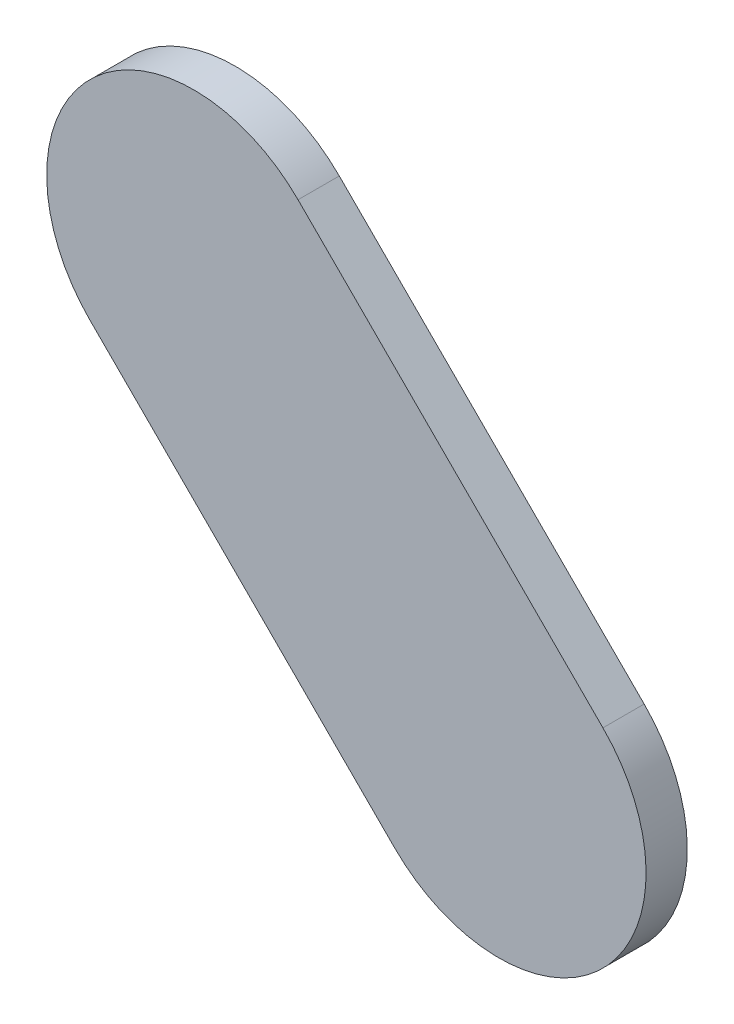
ISO-10303-21;
HEADER;
FILE_DESCRIPTION(('STEP AP214'),'2;1');
FILE_NAME('part.step','',(''),(''),'','','');
FILE_SCHEMA(('AUTOMOTIVE_DESIGN { 1 0 10303 214 1 1 1 1 }'));
ENDSEC;
DATA;
#1=APPLICATION_CONTEXT('core data for automotive mechanical design processes');
#2=APPLICATION_PROTOCOL_DEFINITION('international standard','automotive_design',2000,#1);
#3=PRODUCT_CONTEXT('',#1,'mechanical');
#4=PRODUCT('Part','Part','',(#3));
#5=PRODUCT_RELATED_PRODUCT_CATEGORY('part','',(#4));
#6=PRODUCT_DEFINITION_FORMATION('','',#4);
#7=PRODUCT_DEFINITION_CONTEXT('part definition',#1,'design');
#8=PRODUCT_DEFINITION('design','',#6,#7);
#9=PRODUCT_DEFINITION_SHAPE('','',#8);
#10=(LENGTH_UNIT() NAMED_UNIT(*) SI_UNIT(.MILLI.,.METRE.));
#11=(NAMED_UNIT(*) PLANE_ANGLE_UNIT() SI_UNIT($,.RADIAN.));
#12=(NAMED_UNIT(*) SI_UNIT($,.STERADIAN.) SOLID_ANGLE_UNIT());
#13=UNCERTAINTY_MEASURE_WITH_UNIT(LENGTH_MEASURE(1.E-05),#10,'distance_accuracy_value','');
#14=(GEOMETRIC_REPRESENTATION_CONTEXT(3) GLOBAL_UNCERTAINTY_ASSIGNED_CONTEXT((#13)) GLOBAL_UNIT_ASSIGNED_CONTEXT((#10,
#11,#12)) REPRESENTATION_CONTEXT('',''));
#15=CARTESIAN_POINT('',(0.,0.,0.));
#16=DIRECTION('',(0.,0.,1.));
#17=DIRECTION('',(1.,0.,0.));
#18=AXIS2_PLACEMENT_3D('',#15,#16,#17);
#19=CARTESIAN_POINT('',(95.7641976,87.86009606,0.));
#20=DIRECTION('',(0.707106781186548,0.707106781186548,0.));
#21=DIRECTION('',(0.707106781186548,-0.707106781186548,0.));
#22=AXIS2_PLACEMENT_3D('',#19,#20,#21);
#23=PLANE('',#22);
#24=DIRECTION('',(0.707106781186548,-0.707106781186548,0.));
#25=VECTOR('',#24,1.);
#26=CARTESIAN_POINT('',(95.7641976,87.86009606,0.03556));
#27=LINE('',#26,#25);
#28=CARTESIAN_POINT('',(95.7641976,87.86009606,0.03556));
#29=VERTEX_POINT('',#28);
#30=CARTESIAN_POINT('',(96.0272019,87.59709176,0.03556));
#31=VERTEX_POINT('',#30);
#32=EDGE_CURVE('E11',#29,#31,#27,.T.);
#33=ORIENTED_EDGE('',*,*,#32,.F.);
#34=DIRECTION('',(0.,0.,1.));
#35=VECTOR('',#34,1.);
#36=CARTESIAN_POINT('',(95.7641976,87.86009606,0.));
#37=LINE('',#36,#35);
#38=CARTESIAN_POINT('',(95.7641976,87.86009606,0.));
#39=VERTEX_POINT('',#38);
#40=EDGE_CURVE('E24',#39,#29,#37,.T.);
#41=ORIENTED_EDGE('',*,*,#40,.F.);
#42=DIRECTION('',(0.707106781186548,-0.707106781186548,0.));
#43=VECTOR('',#42,1.);
#44=CARTESIAN_POINT('',(95.7641976,87.86009606,0.));
#45=LINE('',#44,#43);
#46=CARTESIAN_POINT('',(96.0272019,87.59709176,0.));
#47=VERTEX_POINT('',#46);
#48=EDGE_CURVE('E75',#39,#47,#45,.T.);
#49=ORIENTED_EDGE('',*,*,#48,.T.);
#50=DIRECTION('',(0.,0.,1.));
#51=VECTOR('',#50,1.);
#52=CARTESIAN_POINT('',(96.0272019,87.59709176,0.));
#53=LINE('',#52,#51);
#54=EDGE_CURVE('E37',#47,#31,#53,.T.);
#55=ORIENTED_EDGE('',*,*,#54,.T.);
#56=EDGE_LOOP('',(#33,#41,#49,#55));
#57=FACE_BOUND('',#56,.T.);
#58=ADVANCED_FACE('F17',(#57),#23,.F.);
#59=CARTESIAN_POINT('',(96.11700487,87.68689473,0.));
#60=DIRECTION('',(0.,0.,-1.));
#61=DIRECTION('',(-0.707106781186492,-0.707106781186604,0.));
#62=AXIS2_PLACEMENT_3D('',#59,#60,#61);
#63=CYLINDRICAL_SURFACE('',#62,0.127000578115389);
#64=CARTESIAN_POINT('',(96.11700487,87.68689473,0.03556));
#65=DIRECTION('',(0.,0.,1.));
#66=DIRECTION('',(-0.707106781186492,-0.707106781186604,0.));
#67=AXIS2_PLACEMENT_3D('',#64,#65,#66);
#68=CIRCLE('',#67,0.127000578115389);
#69=CARTESIAN_POINT('',(96.20680784,87.7766977,0.03556));
#70=VERTEX_POINT('',#69);
#71=EDGE_CURVE('E83',#31,#70,#68,.T.);
#72=ORIENTED_EDGE('',*,*,#71,.F.);
#73=ORIENTED_EDGE('',*,*,#54,.F.);
#74=CARTESIAN_POINT('',(96.11700487,87.68689473,0.));
#75=DIRECTION('',(0.,0.,1.));
#76=DIRECTION('',(-0.707106781186492,-0.707106781186604,0.));
#77=AXIS2_PLACEMENT_3D('',#74,#75,#76);
#78=CIRCLE('',#77,0.127000578115389);
#79=CARTESIAN_POINT('',(96.20680784,87.7766977,0.));
#80=VERTEX_POINT('',#79);
#81=EDGE_CURVE('E81',#47,#80,#78,.T.);
#82=ORIENTED_EDGE('',*,*,#81,.T.);
#83=DIRECTION('',(0.,0.,1.));
#84=VECTOR('',#83,1.);
#85=CARTESIAN_POINT('',(96.20680784,87.7766977,0.));
#86=LINE('',#85,#84);
#87=EDGE_CURVE('E67',#80,#70,#86,.T.);
#88=ORIENTED_EDGE('',*,*,#87,.T.);
#89=EDGE_LOOP('',(#72,#73,#82,#88));
#90=FACE_BOUND('',#89,.T.);
#91=ADVANCED_FACE('F89',(#90),#63,.T.);
#92=CARTESIAN_POINT('',(96.20680784,87.7766977,0.));
#93=DIRECTION('',(-0.707106781186548,-0.707106781186548,0.));
#94=DIRECTION('',(-0.707106781186548,0.707106781186548,0.));
#95=AXIS2_PLACEMENT_3D('',#92,#93,#94);
#96=PLANE('',#95);
#97=DIRECTION('',(-0.707106781186548,0.707106781186548,0.));
#98=VECTOR('',#97,1.);
#99=CARTESIAN_POINT('',(96.20680784,87.7766977,0.03556));
#100=LINE('',#99,#98);
#101=CARTESIAN_POINT('',(95.94380354,88.039702,0.03556));
#102=VERTEX_POINT('',#101);
#103=EDGE_CURVE('E71',#70,#102,#100,.T.);
#104=ORIENTED_EDGE('',*,*,#103,.F.);
#105=ORIENTED_EDGE('',*,*,#87,.F.);
#106=DIRECTION('',(-0.707106781186548,0.707106781186548,0.));
#107=VECTOR('',#106,1.);
#108=CARTESIAN_POINT('',(96.20680784,87.7766977,0.));
#109=LINE('',#108,#107);
#110=CARTESIAN_POINT('',(95.94380354,88.039702,0.));
#111=VERTEX_POINT('',#110);
#112=EDGE_CURVE('E63',#80,#111,#109,.T.);
#113=ORIENTED_EDGE('',*,*,#112,.T.);
#114=DIRECTION('',(0.,0.,1.));
#115=VECTOR('',#114,1.);
#116=CARTESIAN_POINT('',(95.94380354,88.039702,0.));
#117=LINE('',#116,#115);
#118=EDGE_CURVE('E53',#111,#102,#117,.T.);
#119=ORIENTED_EDGE('',*,*,#118,.T.);
#120=EDGE_LOOP('',(#104,#105,#113,#119));
#121=FACE_BOUND('',#120,.T.);
#122=ADVANCED_FACE('F66',(#121),#96,.F.);
#123=CARTESIAN_POINT('',(95.85400057,87.94989903,0.));
#124=DIRECTION('',(0.,0.,-1.));
#125=DIRECTION('',(0.707106781186604,0.707106781186492,0.));
#126=AXIS2_PLACEMENT_3D('',#123,#124,#125);
#127=CYLINDRICAL_SURFACE('',#126,0.127000578115382);
#128=CARTESIAN_POINT('',(95.85400057,87.94989903,0.03556));
#129=DIRECTION('',(0.,0.,1.));
#130=DIRECTION('',(0.707106781186604,0.707106781186492,0.));
#131=AXIS2_PLACEMENT_3D('',#128,#129,#130);
#132=CIRCLE('',#131,0.127000578115382);
#133=EDGE_CURVE('E59',#102,#29,#132,.T.);
#134=ORIENTED_EDGE('',*,*,#133,.F.);
#135=ORIENTED_EDGE('',*,*,#118,.F.);
#136=CARTESIAN_POINT('',(95.85400057,87.94989903,0.));
#137=DIRECTION('',(0.,0.,1.));
#138=DIRECTION('',(0.707106781186604,0.707106781186492,0.));
#139=AXIS2_PLACEMENT_3D('',#136,#137,#138);
#140=CIRCLE('',#139,0.127000578115382);
#141=EDGE_CURVE('E57',#111,#39,#140,.T.);
#142=ORIENTED_EDGE('',*,*,#141,.T.);
#143=ORIENTED_EDGE('',*,*,#40,.T.);
#144=EDGE_LOOP('',(#134,#135,#142,#143));
#145=FACE_BOUND('',#144,.T.);
#146=ADVANCED_FACE('F55',(#145),#127,.T.);
#147=CARTESIAN_POINT('',(95.7641976,87.86009606,0.));
#148=DIRECTION('',(0.,0.,-1.));
#149=DIRECTION('',(-1.,0.,0.));
#150=AXIS2_PLACEMENT_3D('',#147,#148,#149);
#151=PLANE('',#150);
#152=ORIENTED_EDGE('',*,*,#141,.F.);
#153=ORIENTED_EDGE('',*,*,#112,.F.);
#154=ORIENTED_EDGE('',*,*,#81,.F.);
#155=ORIENTED_EDGE('',*,*,#48,.F.);
#156=EDGE_LOOP('',(#152,#153,#154,#155));
#157=FACE_BOUND('',#156,.T.);
#158=ADVANCED_FACE('F74',(#157),#151,.T.);
#159=CARTESIAN_POINT('',(95.7641976,87.86009606,0.03556));
#160=DIRECTION('',(0.,0.,-1.));
#161=DIRECTION('',(-1.,0.,0.));
#162=AXIS2_PLACEMENT_3D('',#159,#160,#161);
#163=PLANE('',#162);
#164=ORIENTED_EDGE('',*,*,#32,.T.);
#165=ORIENTED_EDGE('',*,*,#71,.T.);
#166=ORIENTED_EDGE('',*,*,#103,.T.);
#167=ORIENTED_EDGE('',*,*,#133,.T.);
#168=EDGE_LOOP('',(#164,#165,#166,#167));
#169=FACE_BOUND('',#168,.T.);
#170=ADVANCED_FACE('F91',(#169),#163,.F.);
#171=CLOSED_SHELL('',(#58,#91,#122,#146,#158,#170));
#172=MANIFOLD_SOLID_BREP('B1',#171);
#173=ADVANCED_BREP_SHAPE_REPRESENTATION('',(#18,#172),#14);
#174=SHAPE_DEFINITION_REPRESENTATION(#9,#173);
ENDSEC;
END-ISO-10303-21;
